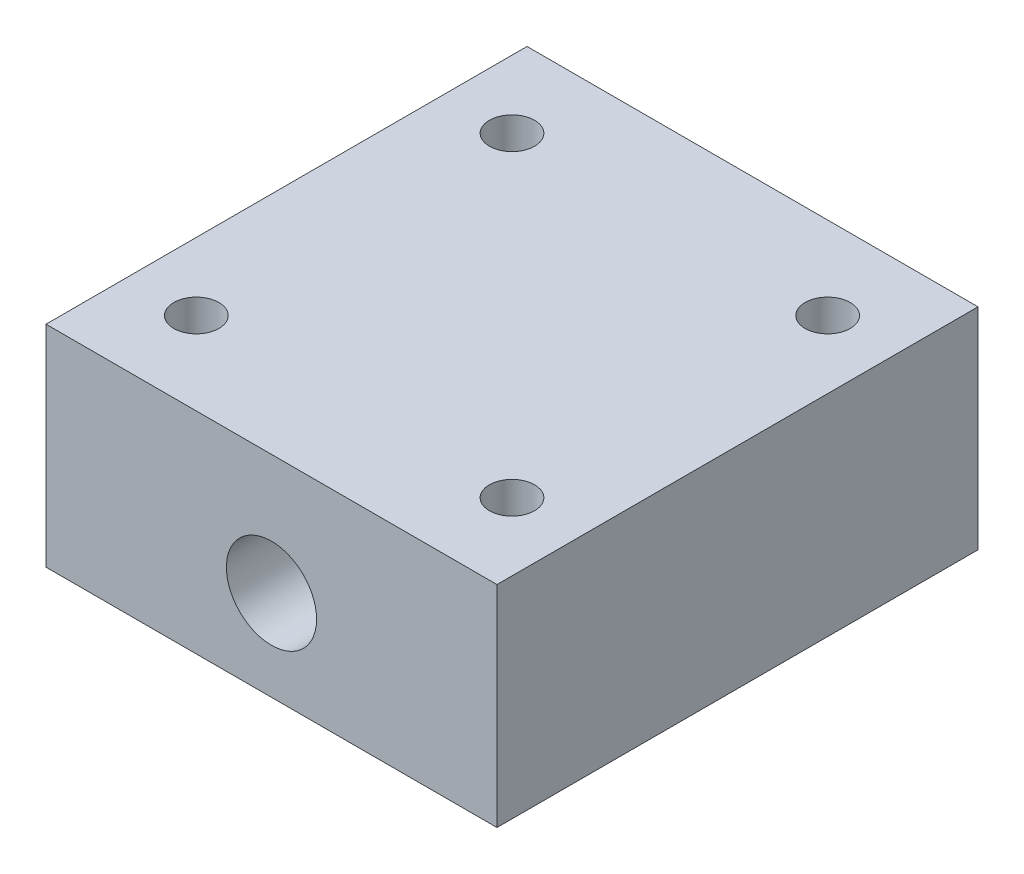
ISO-10303-21;
HEADER;
FILE_DESCRIPTION(('STEP AP214'),'2;1');
FILE_NAME('part.step','',(''),(''),'','','');
FILE_SCHEMA(('AUTOMOTIVE_DESIGN { 1 0 10303 214 1 1 1 1 }'));
ENDSEC;
DATA;
#1=APPLICATION_CONTEXT('core data for automotive mechanical design processes');
#2=APPLICATION_PROTOCOL_DEFINITION('international standard','automotive_design',2000,#1);
#3=PRODUCT_CONTEXT('',#1,'mechanical');
#4=PRODUCT('Part','Part','',(#3));
#5=PRODUCT_RELATED_PRODUCT_CATEGORY('part','',(#4));
#6=PRODUCT_DEFINITION_FORMATION('','',#4);
#7=PRODUCT_DEFINITION_CONTEXT('part definition',#1,'design');
#8=PRODUCT_DEFINITION('design','',#6,#7);
#9=PRODUCT_DEFINITION_SHAPE('','',#8);
#10=(LENGTH_UNIT() NAMED_UNIT(*) SI_UNIT(.MILLI.,.METRE.));
#11=(NAMED_UNIT(*) PLANE_ANGLE_UNIT() SI_UNIT($,.RADIAN.));
#12=(NAMED_UNIT(*) SI_UNIT($,.STERADIAN.) SOLID_ANGLE_UNIT());
#13=UNCERTAINTY_MEASURE_WITH_UNIT(LENGTH_MEASURE(1.E-05),#10,'distance_accuracy_value','');
#14=(GEOMETRIC_REPRESENTATION_CONTEXT(3) GLOBAL_UNCERTAINTY_ASSIGNED_CONTEXT((#13)) GLOBAL_UNIT_ASSIGNED_CONTEXT((#10,
#11,#12)) REPRESENTATION_CONTEXT('',''));
#15=CARTESIAN_POINT('',(0.,0.,0.));
#16=DIRECTION('',(0.,0.,1.));
#17=DIRECTION('',(1.,0.,0.));
#18=AXIS2_PLACEMENT_3D('',#15,#16,#17);
#19=CARTESIAN_POINT('',(-15.,-6.,44.2843781207323));
#20=DIRECTION('',(-1.,0.,0.));
#21=DIRECTION('',(0.,0.,1.));
#22=AXIS2_PLACEMENT_3D('',#19,#20,#21);
#23=PLANE('',#22);
#24=DIRECTION('',(0.,0.,1.));
#25=VECTOR('',#24,1.);
#26=CARTESIAN_POINT('',(-15.,8.,44.2843781207323));
#27=LINE('',#26,#25);
#28=CARTESIAN_POINT('',(-15.,8.,44.2843781207323));
#29=VERTEX_POINT('',#28);
#30=CARTESIAN_POINT('',(-15.,8.,76.2843781207323));
#31=VERTEX_POINT('',#30);
#32=EDGE_CURVE('E140',#29,#31,#27,.T.);
#33=ORIENTED_EDGE('',*,*,#32,.F.);
#34=DIRECTION('',(0.,1.,0.));
#35=VECTOR('',#34,1.);
#36=CARTESIAN_POINT('',(-15.,-6.,44.2843781207323));
#37=LINE('',#36,#35);
#38=CARTESIAN_POINT('',(-15.,-6.,44.2843781207323));
#39=VERTEX_POINT('',#38);
#40=EDGE_CURVE('E11',#39,#29,#37,.T.);
#41=ORIENTED_EDGE('',*,*,#40,.F.);
#42=DIRECTION('',(0.,0.,1.));
#43=VECTOR('',#42,1.);
#44=CARTESIAN_POINT('',(-15.,-6.,44.2843781207323));
#45=LINE('',#44,#43);
#46=CARTESIAN_POINT('',(-15.,-6.,76.2843781207323));
#47=VERTEX_POINT('',#46);
#48=EDGE_CURVE('E141',#39,#47,#45,.T.);
#49=ORIENTED_EDGE('',*,*,#48,.T.);
#50=DIRECTION('',(0.,1.,0.));
#51=VECTOR('',#50,1.);
#52=CARTESIAN_POINT('',(-15.,-6.,76.2843781207323));
#53=LINE('',#52,#51);
#54=EDGE_CURVE('E85',#47,#31,#53,.T.);
#55=ORIENTED_EDGE('',*,*,#54,.T.);
#56=EDGE_LOOP('',(#33,#41,#49,#55));
#57=FACE_BOUND('',#56,.T.);
#58=ADVANCED_FACE('F40',(#57),#23,.T.);
#59=CARTESIAN_POINT('',(-15.,-6.,44.2843781207323));
#60=DIRECTION('',(0.,0.,-1.));
#61=DIRECTION('',(-1.,0.,0.));
#62=AXIS2_PLACEMENT_3D('',#59,#60,#61);
#63=PLANE('',#62);
#64=CARTESIAN_POINT('',(0.,0.,44.2843781207323));
#65=DIRECTION('',(0.,0.,-1.));
#66=DIRECTION('',(-1.,0.,0.));
#67=AXIS2_PLACEMENT_3D('',#64,#65,#66);
#68=CIRCLE('',#67,3.);
#69=CARTESIAN_POINT('',(-3.,0.,44.2843781207323));
#70=VERTEX_POINT('',#69);
#71=EDGE_CURVE('E137',#70,#70,#68,.T.);
#72=ORIENTED_EDGE('',*,*,#71,.F.);
#73=EDGE_LOOP('',(#72));
#74=FACE_BOUND('',#73,.T.);
#75=DIRECTION('',(-1.,0.,0.));
#76=VECTOR('',#75,1.);
#77=CARTESIAN_POINT('',(-15.,8.,44.2843781207323));
#78=LINE('',#77,#76);
#79=CARTESIAN_POINT('',(15.,8.,44.2843781207323));
#80=VERTEX_POINT('',#79);
#81=EDGE_CURVE('E145',#80,#29,#78,.T.);
#82=ORIENTED_EDGE('',*,*,#81,.F.);
#83=DIRECTION('',(0.,1.,0.));
#84=VECTOR('',#83,1.);
#85=CARTESIAN_POINT('',(15.,-6.,44.2843781207323));
#86=LINE('',#85,#84);
#87=CARTESIAN_POINT('',(15.,-6.,44.2843781207323));
#88=VERTEX_POINT('',#87);
#89=EDGE_CURVE('E49',#88,#80,#86,.T.);
#90=ORIENTED_EDGE('',*,*,#89,.F.);
#91=DIRECTION('',(-1.,0.,0.));
#92=VECTOR('',#91,1.);
#93=CARTESIAN_POINT('',(-15.,-6.,44.2843781207323));
#94=LINE('',#93,#92);
#95=EDGE_CURVE('E149',#88,#39,#94,.T.);
#96=ORIENTED_EDGE('',*,*,#95,.T.);
#97=ORIENTED_EDGE('',*,*,#40,.T.);
#98=EDGE_LOOP('',(#82,#90,#96,#97));
#99=FACE_BOUND('',#98,.T.);
#100=ADVANCED_FACE('F168',(#74,#99),#63,.T.);
#101=CARTESIAN_POINT('',(15.,-6.,44.2843781207323));
#102=DIRECTION('',(1.,0.,0.));
#103=DIRECTION('',(0.,0.,-1.));
#104=AXIS2_PLACEMENT_3D('',#101,#102,#103);
#105=PLANE('',#104);
#106=DIRECTION('',(0.,0.,-1.));
#107=VECTOR('',#106,1.);
#108=CARTESIAN_POINT('',(15.,8.,44.2843781207323));
#109=LINE('',#108,#107);
#110=CARTESIAN_POINT('',(15.,8.,76.2843781207323));
#111=VERTEX_POINT('',#110);
#112=EDGE_CURVE('E157',#111,#80,#109,.T.);
#113=ORIENTED_EDGE('',*,*,#112,.F.);
#114=DIRECTION('',(0.,1.,0.));
#115=VECTOR('',#114,1.);
#116=CARTESIAN_POINT('',(15.,-6.,76.2843781207323));
#117=LINE('',#116,#115);
#118=CARTESIAN_POINT('',(15.,-6.,76.2843781207323));
#119=VERTEX_POINT('',#118);
#120=EDGE_CURVE('E163',#119,#111,#117,.T.);
#121=ORIENTED_EDGE('',*,*,#120,.F.);
#122=DIRECTION('',(0.,0.,-1.));
#123=VECTOR('',#122,1.);
#124=CARTESIAN_POINT('',(15.,-6.,44.2843781207323));
#125=LINE('',#124,#123);
#126=EDGE_CURVE('E147',#119,#88,#125,.T.);
#127=ORIENTED_EDGE('',*,*,#126,.T.);
#128=ORIENTED_EDGE('',*,*,#89,.T.);
#129=EDGE_LOOP('',(#113,#121,#127,#128));
#130=FACE_BOUND('',#129,.T.);
#131=ADVANCED_FACE('F171',(#130),#105,.T.);
#132=CARTESIAN_POINT('',(-15.,-6.,76.2843781207323));
#133=DIRECTION('',(0.,0.,1.));
#134=DIRECTION('',(1.,0.,0.));
#135=AXIS2_PLACEMENT_3D('',#132,#133,#134);
#136=PLANE('',#135);
#137=CARTESIAN_POINT('',(0.,0.,76.2843781207323));
#138=DIRECTION('',(0.,0.,1.));
#139=DIRECTION('',(1.,0.,0.));
#140=AXIS2_PLACEMENT_3D('',#137,#138,#139);
#141=CIRCLE('',#140,3.);
#142=CARTESIAN_POINT('',(3.,0.,76.2843781207323));
#143=VERTEX_POINT('',#142);
#144=EDGE_CURVE('E43',#143,#143,#141,.T.);
#145=ORIENTED_EDGE('',*,*,#144,.F.);
#146=EDGE_LOOP('',(#145));
#147=FACE_BOUND('',#146,.T.);
#148=DIRECTION('',(1.,0.,0.));
#149=VECTOR('',#148,1.);
#150=CARTESIAN_POINT('',(-15.,8.,76.2843781207323));
#151=LINE('',#150,#149);
#152=EDGE_CURVE('E153',#31,#111,#151,.T.);
#153=ORIENTED_EDGE('',*,*,#152,.F.);
#154=ORIENTED_EDGE('',*,*,#54,.F.);
#155=DIRECTION('',(1.,0.,0.));
#156=VECTOR('',#155,1.);
#157=CARTESIAN_POINT('',(-15.,-6.,76.2843781207323));
#158=LINE('',#157,#156);
#159=EDGE_CURVE('E144',#47,#119,#158,.T.);
#160=ORIENTED_EDGE('',*,*,#159,.T.);
#161=ORIENTED_EDGE('',*,*,#120,.T.);
#162=EDGE_LOOP('',(#153,#154,#160,#161));
#163=FACE_BOUND('',#162,.T.);
#164=ADVANCED_FACE('F165',(#147,#163),#136,.T.);
#165=CARTESIAN_POINT('',(0.,-6.,0.));
#166=DIRECTION('',(0.,1.,0.));
#167=DIRECTION('',(0.,0.,1.));
#168=AXIS2_PLACEMENT_3D('',#165,#166,#167);
#169=PLANE('',#168);
#170=ORIENTED_EDGE('',*,*,#48,.F.);
#171=ORIENTED_EDGE('',*,*,#95,.F.);
#172=ORIENTED_EDGE('',*,*,#126,.F.);
#173=ORIENTED_EDGE('',*,*,#159,.F.);
#174=EDGE_LOOP('',(#170,#171,#172,#173));
#175=FACE_BOUND('',#174,.T.);
#176=ADVANCED_FACE('F173',(#175),#169,.F.);
#177=CARTESIAN_POINT('',(0.,8.,0.));
#178=DIRECTION('',(0.,1.,0.));
#179=DIRECTION('',(0.,0.,1.));
#180=AXIS2_PLACEMENT_3D('',#177,#178,#179);
#181=PLANE('',#180);
#182=CARTESIAN_POINT('',(10.5,8.,49.7843781207323));
#183=DIRECTION('',(0.,1.,0.));
#184=DIRECTION('',(0.,0.,1.));
#185=AXIS2_PLACEMENT_3D('',#182,#183,#184);
#186=CIRCLE('',#185,1.5);
#187=CARTESIAN_POINT('',(10.5,8.,51.2843781207323));
#188=VERTEX_POINT('',#187);
#189=EDGE_CURVE('E112',#188,#188,#186,.T.);
#190=ORIENTED_EDGE('',*,*,#189,.F.);
#191=EDGE_LOOP('',(#190));
#192=FACE_BOUND('',#191,.T.);
#193=CARTESIAN_POINT('',(-10.5,8.,49.7843781207323));
#194=DIRECTION('',(0.,1.,0.));
#195=DIRECTION('',(0.,0.,1.));
#196=AXIS2_PLACEMENT_3D('',#193,#194,#195);
#197=CIRCLE('',#196,1.5);
#198=CARTESIAN_POINT('',(-10.5,8.,51.2843781207323));
#199=VERTEX_POINT('',#198);
#200=EDGE_CURVE('E111',#199,#199,#197,.T.);
#201=ORIENTED_EDGE('',*,*,#200,.F.);
#202=EDGE_LOOP('',(#201));
#203=FACE_BOUND('',#202,.T.);
#204=CARTESIAN_POINT('',(-10.5,8.,70.7843781207323));
#205=DIRECTION('',(0.,1.,0.));
#206=DIRECTION('',(0.,0.,1.));
#207=AXIS2_PLACEMENT_3D('',#204,#205,#206);
#208=CIRCLE('',#207,1.5);
#209=CARTESIAN_POINT('',(-10.5,8.,72.2843781207323));
#210=VERTEX_POINT('',#209);
#211=EDGE_CURVE('E122',#210,#210,#208,.T.);
#212=ORIENTED_EDGE('',*,*,#211,.F.);
#213=EDGE_LOOP('',(#212));
#214=FACE_BOUND('',#213,.T.);
#215=CARTESIAN_POINT('',(10.5,8.,70.7843781207323));
#216=DIRECTION('',(0.,1.,0.));
#217=DIRECTION('',(0.,0.,1.));
#218=AXIS2_PLACEMENT_3D('',#215,#216,#217);
#219=CIRCLE('',#218,1.5);
#220=CARTESIAN_POINT('',(10.5,8.,72.2843781207323));
#221=VERTEX_POINT('',#220);
#222=EDGE_CURVE('E129',#221,#221,#219,.T.);
#223=ORIENTED_EDGE('',*,*,#222,.F.);
#224=EDGE_LOOP('',(#223));
#225=FACE_BOUND('',#224,.T.);
#226=ORIENTED_EDGE('',*,*,#32,.T.);
#227=ORIENTED_EDGE('',*,*,#152,.T.);
#228=ORIENTED_EDGE('',*,*,#112,.T.);
#229=ORIENTED_EDGE('',*,*,#81,.T.);
#230=EDGE_LOOP('',(#226,#227,#228,#229));
#231=FACE_BOUND('',#230,.T.);
#232=ADVANCED_FACE('F167',(#192,#203,#214,#225,#231),#181,.T.);
#233=CARTESIAN_POINT('',(0.,0.,0.869578928107368));
#234=DIRECTION('',(0.,0.,1.));
#235=DIRECTION('',(1.,0.,0.));
#236=AXIS2_PLACEMENT_3D('',#233,#234,#235);
#237=CYLINDRICAL_SURFACE('',#236,3.);
#238=ORIENTED_EDGE('',*,*,#71,.T.);
#239=EDGE_LOOP('',(#238));
#240=FACE_BOUND('',#239,.T.);
#241=ORIENTED_EDGE('',*,*,#144,.T.);
#242=EDGE_LOOP('',(#241));
#243=FACE_BOUND('',#242,.T.);
#244=ADVANCED_FACE('F180',(#240,#243),#237,.F.);
#245=CARTESIAN_POINT('',(10.5,0.999999999999997,70.7843781207323));
#246=DIRECTION('',(0.,1.,0.));
#247=DIRECTION('',(0.,0.,1.));
#248=AXIS2_PLACEMENT_3D('',#245,#246,#247);
#249=CONICAL_SURFACE('',#248,1.5,1.02974425867665);
#250=CARTESIAN_POINT('',(10.5,0.0987090714586556,70.7843781207323));
#251=VERTEX_POINT('',#250);
#252=VERTEX_LOOP('',#251);
#253=FACE_BOUND('',#252,.T.);
#254=CARTESIAN_POINT('',(10.5,0.999999999999997,70.7843781207323));
#255=DIRECTION('',(0.,1.,0.));
#256=DIRECTION('',(0.,0.,1.));
#257=AXIS2_PLACEMENT_3D('',#254,#255,#256);
#258=CIRCLE('',#257,1.5);
#259=CARTESIAN_POINT('',(10.5,0.999999999999997,72.2843781207323));
#260=VERTEX_POINT('',#259);
#261=EDGE_CURVE('E133',#260,#260,#258,.T.);
#262=ORIENTED_EDGE('',*,*,#261,.T.);
#263=EDGE_LOOP('',(#262));
#264=FACE_BOUND('',#263,.T.);
#265=ADVANCED_FACE('F199',(#253,#264),#249,.F.);
#266=CARTESIAN_POINT('',(10.5,8.,70.7843781207323));
#267=DIRECTION('',(0.,1.,0.));
#268=DIRECTION('',(0.,0.,1.));
#269=AXIS2_PLACEMENT_3D('',#266,#267,#268);
#270=CYLINDRICAL_SURFACE('',#269,1.5);
#271=ORIENTED_EDGE('',*,*,#261,.F.);
#272=EDGE_LOOP('',(#271));
#273=FACE_BOUND('',#272,.T.);
#274=ORIENTED_EDGE('',*,*,#222,.T.);
#275=EDGE_LOOP('',(#274));
#276=FACE_BOUND('',#275,.T.);
#277=ADVANCED_FACE('F205',(#273,#276),#270,.F.);
#278=CARTESIAN_POINT('',(-10.5,0.999999999999997,70.7843781207323));
#279=DIRECTION('',(0.,1.,0.));
#280=DIRECTION('',(0.,0.,1.));
#281=AXIS2_PLACEMENT_3D('',#278,#279,#280);
#282=CONICAL_SURFACE('',#281,1.5,1.02974425867665);
#283=CARTESIAN_POINT('',(-10.5,0.0987090714586556,70.7843781207323));
#284=VERTEX_POINT('',#283);
#285=VERTEX_LOOP('',#284);
#286=FACE_BOUND('',#285,.T.);
#287=CARTESIAN_POINT('',(-10.5,0.999999999999997,70.7843781207323));
#288=DIRECTION('',(0.,1.,0.));
#289=DIRECTION('',(0.,0.,1.));
#290=AXIS2_PLACEMENT_3D('',#287,#288,#289);
#291=CIRCLE('',#290,1.5);
#292=CARTESIAN_POINT('',(-10.5,0.999999999999997,72.2843781207323));
#293=VERTEX_POINT('',#292);
#294=EDGE_CURVE('E126',#293,#293,#291,.T.);
#295=ORIENTED_EDGE('',*,*,#294,.T.);
#296=EDGE_LOOP('',(#295));
#297=FACE_BOUND('',#296,.T.);
#298=ADVANCED_FACE('F211',(#286,#297),#282,.F.);
#299=CARTESIAN_POINT('',(-10.5,8.,70.7843781207323));
#300=DIRECTION('',(0.,1.,0.));
#301=DIRECTION('',(0.,0.,1.));
#302=AXIS2_PLACEMENT_3D('',#299,#300,#301);
#303=CYLINDRICAL_SURFACE('',#302,1.5);
#304=ORIENTED_EDGE('',*,*,#294,.F.);
#305=EDGE_LOOP('',(#304));
#306=FACE_BOUND('',#305,.T.);
#307=ORIENTED_EDGE('',*,*,#211,.T.);
#308=EDGE_LOOP('',(#307));
#309=FACE_BOUND('',#308,.T.);
#310=ADVANCED_FACE('F215',(#306,#309),#303,.F.);
#311=CARTESIAN_POINT('',(-10.5,0.999999999999997,49.7843781207323));
#312=DIRECTION('',(0.,1.,0.));
#313=DIRECTION('',(0.,0.,1.));
#314=AXIS2_PLACEMENT_3D('',#311,#312,#313);
#315=CONICAL_SURFACE('',#314,1.5,1.02974425867665);
#316=CARTESIAN_POINT('',(-10.5,0.0987090714586556,49.7843781207323));
#317=VERTEX_POINT('',#316);
#318=VERTEX_LOOP('',#317);
#319=FACE_BOUND('',#318,.T.);
#320=CARTESIAN_POINT('',(-10.5,0.999999999999997,49.7843781207323));
#321=DIRECTION('',(0.,1.,0.));
#322=DIRECTION('',(0.,0.,1.));
#323=AXIS2_PLACEMENT_3D('',#320,#321,#322);
#324=CIRCLE('',#323,1.5);
#325=CARTESIAN_POINT('',(-10.5,0.999999999999997,51.2843781207323));
#326=VERTEX_POINT('',#325);
#327=EDGE_CURVE('E115',#326,#326,#324,.T.);
#328=ORIENTED_EDGE('',*,*,#327,.T.);
#329=EDGE_LOOP('',(#328));
#330=FACE_BOUND('',#329,.T.);
#331=ADVANCED_FACE('F219',(#319,#330),#315,.F.);
#332=CARTESIAN_POINT('',(-10.5,8.,49.7843781207323));
#333=DIRECTION('',(0.,1.,0.));
#334=DIRECTION('',(0.,0.,1.));
#335=AXIS2_PLACEMENT_3D('',#332,#333,#334);
#336=CYLINDRICAL_SURFACE('',#335,1.5);
#337=ORIENTED_EDGE('',*,*,#327,.F.);
#338=EDGE_LOOP('',(#337));
#339=FACE_BOUND('',#338,.T.);
#340=ORIENTED_EDGE('',*,*,#200,.T.);
#341=EDGE_LOOP('',(#340));
#342=FACE_BOUND('',#341,.T.);
#343=ADVANCED_FACE('F105',(#339,#342),#336,.F.);
#344=CARTESIAN_POINT('',(10.5,0.999999999999997,49.7843781207323));
#345=DIRECTION('',(0.,1.,0.));
#346=DIRECTION('',(0.,0.,1.));
#347=AXIS2_PLACEMENT_3D('',#344,#345,#346);
#348=CONICAL_SURFACE('',#347,1.5,1.02974425867665);
#349=CARTESIAN_POINT('',(10.5,0.0987090714586556,49.7843781207323));
#350=VERTEX_POINT('',#349);
#351=VERTEX_LOOP('',#350);
#352=FACE_BOUND('',#351,.T.);
#353=CARTESIAN_POINT('',(10.5,0.999999999999997,49.7843781207323));
#354=DIRECTION('',(0.,1.,0.));
#355=DIRECTION('',(0.,0.,1.));
#356=AXIS2_PLACEMENT_3D('',#353,#354,#355);
#357=CIRCLE('',#356,1.5);
#358=CARTESIAN_POINT('',(10.5,0.999999999999997,51.2843781207323));
#359=VERTEX_POINT('',#358);
#360=EDGE_CURVE('E109',#359,#359,#357,.T.);
#361=ORIENTED_EDGE('',*,*,#360,.T.);
#362=EDGE_LOOP('',(#361));
#363=FACE_BOUND('',#362,.T.);
#364=ADVANCED_FACE('F101',(#352,#363),#348,.F.);
#365=CARTESIAN_POINT('',(10.5,8.,49.7843781207323));
#366=DIRECTION('',(0.,1.,0.));
#367=DIRECTION('',(0.,0.,1.));
#368=AXIS2_PLACEMENT_3D('',#365,#366,#367);
#369=CYLINDRICAL_SURFACE('',#368,1.5);
#370=ORIENTED_EDGE('',*,*,#360,.F.);
#371=EDGE_LOOP('',(#370));
#372=FACE_BOUND('',#371,.T.);
#373=ORIENTED_EDGE('',*,*,#189,.T.);
#374=EDGE_LOOP('',(#373));
#375=FACE_BOUND('',#374,.T.);
#376=ADVANCED_FACE('F104',(#372,#375),#369,.F.);
#377=CLOSED_SHELL('',(#58,#100,#131,#164,#176,#232,#244,#265,#277,#298,#310,#331,#343,#364,#376));
#378=MANIFOLD_SOLID_BREP('B2',#377);
#379=ADVANCED_BREP_SHAPE_REPRESENTATION('',(#18,#378),#14);
#380=SHAPE_DEFINITION_REPRESENTATION(#9,#379);
ENDSEC;
END-ISO-10303-21;
